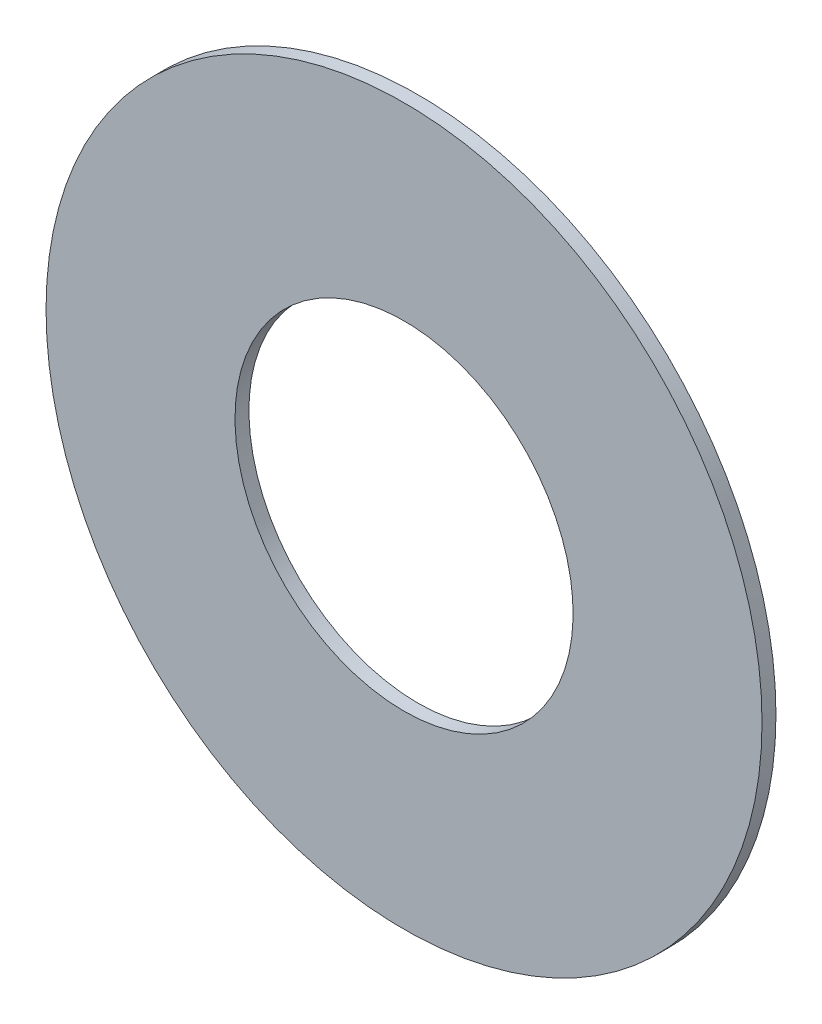
ISO-10303-21;
HEADER;
FILE_DESCRIPTION(('STEP AP214'),'2;1');
FILE_NAME('part.step','',(''),(''),'','','');
FILE_SCHEMA(('AUTOMOTIVE_DESIGN { 1 0 10303 214 1 1 1 1 }'));
ENDSEC;
DATA;
#1=APPLICATION_CONTEXT('core data for automotive mechanical design processes');
#2=APPLICATION_PROTOCOL_DEFINITION('international standard','automotive_design',2000,#1);
#3=PRODUCT_CONTEXT('',#1,'mechanical');
#4=PRODUCT('Part','Part','',(#3));
#5=PRODUCT_RELATED_PRODUCT_CATEGORY('part','',(#4));
#6=PRODUCT_DEFINITION_FORMATION('','',#4);
#7=PRODUCT_DEFINITION_CONTEXT('part definition',#1,'design');
#8=PRODUCT_DEFINITION('design','',#6,#7);
#9=PRODUCT_DEFINITION_SHAPE('','',#8);
#10=(LENGTH_UNIT() NAMED_UNIT(*) SI_UNIT(.MILLI.,.METRE.));
#11=(NAMED_UNIT(*) PLANE_ANGLE_UNIT() SI_UNIT($,.RADIAN.));
#12=(NAMED_UNIT(*) SI_UNIT($,.STERADIAN.) SOLID_ANGLE_UNIT());
#13=UNCERTAINTY_MEASURE_WITH_UNIT(LENGTH_MEASURE(1.E-05),#10,'distance_accuracy_value','');
#14=(GEOMETRIC_REPRESENTATION_CONTEXT(3) GLOBAL_UNCERTAINTY_ASSIGNED_CONTEXT((#13)) GLOBAL_UNIT_ASSIGNED_CONTEXT((#10,
#11,#12)) REPRESENTATION_CONTEXT('',''));
#15=CARTESIAN_POINT('',(0.,0.,0.));
#16=DIRECTION('',(0.,0.,1.));
#17=DIRECTION('',(1.,0.,0.));
#18=AXIS2_PLACEMENT_3D('',#15,#16,#17);
#19=CARTESIAN_POINT('',(171.958,-153.249,-0.045));
#20=DIRECTION('',(0.,0.,-1.));
#21=DIRECTION('',(0.,-1.,0.));
#22=AXIS2_PLACEMENT_3D('',#19,#20,#21);
#23=CYLINDRICAL_SURFACE('',#22,0.425);
#24=CARTESIAN_POINT('',(171.958,-153.249,-0.035));
#25=DIRECTION('',(0.,0.,-1.));
#26=DIRECTION('',(0.,-1.,0.));
#27=AXIS2_PLACEMENT_3D('',#24,#25,#26);
#28=CIRCLE('',#27,0.425);
#29=CARTESIAN_POINT('',(171.958,-153.674,-0.035));
#30=VERTEX_POINT('',#29);
#31=EDGE_CURVE('E20',#30,#30,#28,.T.);
#32=ORIENTED_EDGE('',*,*,#31,.T.);
#33=DIRECTION('',(0.,0.,1.));
#34=VECTOR('',#33,1.);
#35=CARTESIAN_POINT('',(171.958,-153.674,-0.045));
#36=LINE('',#35,#34);
#37=CARTESIAN_POINT('',(171.958,-153.674,0.));
#38=VERTEX_POINT('',#37);
#39=EDGE_CURVE('E11',#30,#38,#36,.T.);
#40=ORIENTED_EDGE('',*,*,#39,.T.);
#41=CARTESIAN_POINT('',(171.958,-153.249,0.));
#42=DIRECTION('',(0.,0.,-1.));
#43=DIRECTION('',(0.,-1.,0.));
#44=AXIS2_PLACEMENT_3D('',#41,#42,#43);
#45=CIRCLE('',#44,0.425);
#46=EDGE_CURVE('E56',#38,#38,#45,.T.);
#47=ORIENTED_EDGE('',*,*,#46,.F.);
#48=ORIENTED_EDGE('',*,*,#39,.F.);
#49=EDGE_LOOP('',(#32,#40,#47,#48));
#50=FACE_BOUND('',#49,.T.);
#51=ADVANCED_FACE('F17',(#50),#23,.F.);
#52=CARTESIAN_POINT('',(171.958,-153.249,-0.035));
#53=DIRECTION('',(0.,0.,1.));
#54=DIRECTION('',(1.,0.,0.));
#55=AXIS2_PLACEMENT_3D('',#52,#53,#54);
#56=PLANE('',#55);
#57=ORIENTED_EDGE('',*,*,#31,.F.);
#58=EDGE_LOOP('',(#57));
#59=FACE_BOUND('',#58,.T.);
#60=CARTESIAN_POINT('',(171.958,-153.249,-0.035));
#61=DIRECTION('',(0.,0.,1.));
#62=DIRECTION('',(1.,0.,0.));
#63=AXIS2_PLACEMENT_3D('',#60,#61,#62);
#64=CIRCLE('',#63,0.9);
#65=CARTESIAN_POINT('',(172.858,-153.249,-0.035));
#66=VERTEX_POINT('',#65);
#67=EDGE_CURVE('E49',#66,#66,#64,.T.);
#68=ORIENTED_EDGE('',*,*,#67,.F.);
#69=EDGE_LOOP('',(#68));
#70=FACE_BOUND('',#69,.T.);
#71=ADVANCED_FACE('F73',(#59,#70),#56,.F.);
#72=CARTESIAN_POINT('',(171.958,-153.249,0.));
#73=DIRECTION('',(0.,0.,1.));
#74=DIRECTION('',(1.,0.,0.));
#75=AXIS2_PLACEMENT_3D('',#72,#73,#74);
#76=PLANE('',#75);
#77=ORIENTED_EDGE('',*,*,#46,.T.);
#78=EDGE_LOOP('',(#77));
#79=FACE_BOUND('',#78,.T.);
#80=CARTESIAN_POINT('',(171.958,-153.249,0.));
#81=DIRECTION('',(0.,0.,1.));
#82=DIRECTION('',(1.,0.,0.));
#83=AXIS2_PLACEMENT_3D('',#80,#81,#82);
#84=CIRCLE('',#83,0.9);
#85=CARTESIAN_POINT('',(172.858,-153.249,0.));
#86=VERTEX_POINT('',#85);
#87=EDGE_CURVE('E64',#86,#86,#84,.T.);
#88=ORIENTED_EDGE('',*,*,#87,.T.);
#89=EDGE_LOOP('',(#88));
#90=FACE_BOUND('',#89,.T.);
#91=ADVANCED_FACE('F71',(#79,#90),#76,.T.);
#92=CARTESIAN_POINT('',(171.958,-153.249,-0.035));
#93=DIRECTION('',(0.,0.,1.));
#94=DIRECTION('',(1.,0.,0.));
#95=AXIS2_PLACEMENT_3D('',#92,#93,#94);
#96=CYLINDRICAL_SURFACE('',#95,0.9);
#97=ORIENTED_EDGE('',*,*,#87,.F.);
#98=DIRECTION('',(0.,0.,1.));
#99=VECTOR('',#98,1.);
#100=CARTESIAN_POINT('',(172.858,-153.249,-0.035));
#101=LINE('',#100,#99);
#102=EDGE_CURVE('E52',#66,#86,#101,.T.);
#103=ORIENTED_EDGE('',*,*,#102,.F.);
#104=ORIENTED_EDGE('',*,*,#67,.T.);
#105=ORIENTED_EDGE('',*,*,#102,.T.);
#106=EDGE_LOOP('',(#97,#103,#104,#105));
#107=FACE_BOUND('',#106,.T.);
#108=ADVANCED_FACE('F51',(#107),#96,.T.);
#109=CLOSED_SHELL('',(#51,#71,#91,#108));
#110=MANIFOLD_SOLID_BREP('B1',#109);
#111=ADVANCED_BREP_SHAPE_REPRESENTATION('',(#18,#110),#14);
#112=SHAPE_DEFINITION_REPRESENTATION(#9,#111);
ENDSEC;
END-ISO-10303-21;
